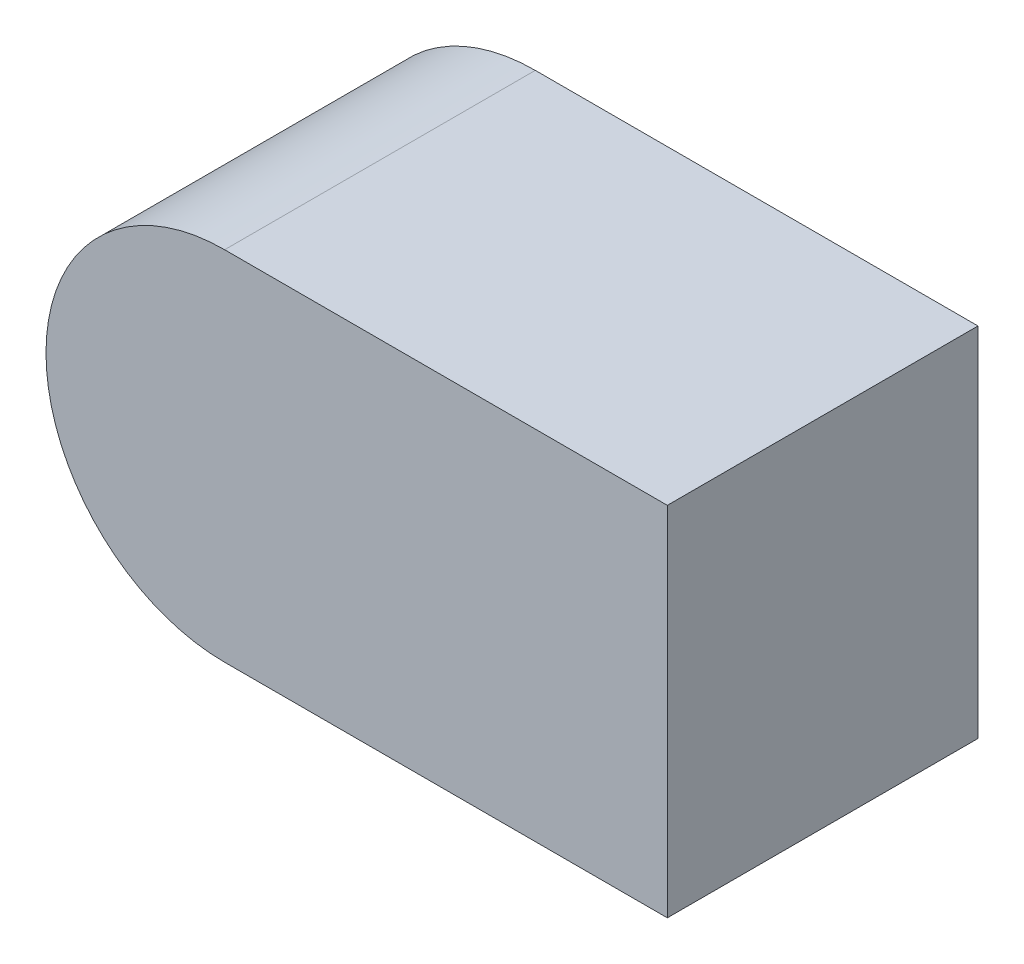
ISO-10303-21;
HEADER;
FILE_DESCRIPTION(('STEP AP214'),'2;1');
FILE_NAME('part.step','',(''),(''),'','','');
FILE_SCHEMA(('AUTOMOTIVE_DESIGN { 1 0 10303 214 1 1 1 1 }'));
ENDSEC;
DATA;
#1=APPLICATION_CONTEXT('core data for automotive mechanical design processes');
#2=APPLICATION_PROTOCOL_DEFINITION('international standard','automotive_design',2000,#1);
#3=PRODUCT_CONTEXT('',#1,'mechanical');
#4=PRODUCT('Part','Part','',(#3));
#5=PRODUCT_RELATED_PRODUCT_CATEGORY('part','',(#4));
#6=PRODUCT_DEFINITION_FORMATION('','',#4);
#7=PRODUCT_DEFINITION_CONTEXT('part definition',#1,'design');
#8=PRODUCT_DEFINITION('design','',#6,#7);
#9=PRODUCT_DEFINITION_SHAPE('','',#8);
#10=(LENGTH_UNIT() NAMED_UNIT(*) SI_UNIT(.MILLI.,.METRE.));
#11=(NAMED_UNIT(*) PLANE_ANGLE_UNIT() SI_UNIT($,.RADIAN.));
#12=(NAMED_UNIT(*) SI_UNIT($,.STERADIAN.) SOLID_ANGLE_UNIT());
#13=UNCERTAINTY_MEASURE_WITH_UNIT(LENGTH_MEASURE(1.E-05),#10,'distance_accuracy_value','');
#14=(GEOMETRIC_REPRESENTATION_CONTEXT(3) GLOBAL_UNCERTAINTY_ASSIGNED_CONTEXT((#13)) GLOBAL_UNIT_ASSIGNED_CONTEXT((#10,
#11,#12)) REPRESENTATION_CONTEXT('',''));
#15=CARTESIAN_POINT('',(0.,0.,0.));
#16=DIRECTION('',(0.,0.,1.));
#17=DIRECTION('',(1.,0.,0.));
#18=AXIS2_PLACEMENT_3D('',#15,#16,#17);
#19=CARTESIAN_POINT('',(2.8335240809167,0.249999999999999,0.2));
#20=DIRECTION('',(0.,0.,1.));
#21=DIRECTION('',(1.,0.,0.));
#22=AXIS2_PLACEMENT_3D('',#19,#20,#21);
#23=PLANE('',#22);
#24=DIRECTION('',(1.,0.,0.));
#25=VECTOR('',#24,1.);
#26=CARTESIAN_POINT('',(2.715,0.135,0.2));
#27=LINE('',#26,#25);
#28=CARTESIAN_POINT('',(2.715,0.135,0.2));
#29=VERTEX_POINT('',#28);
#30=CARTESIAN_POINT('',(3.,0.135,0.2));
#31=VERTEX_POINT('',#30);
#32=EDGE_CURVE('E11',#29,#31,#27,.T.);
#33=ORIENTED_EDGE('',*,*,#32,.T.);
#34=DIRECTION('',(0.,1.,0.));
#35=VECTOR('',#34,1.);
#36=CARTESIAN_POINT('',(3.,-1.375,0.2));
#37=LINE('',#36,#35);
#38=CARTESIAN_POINT('',(3.,0.364999999999999,0.2));
#39=VERTEX_POINT('',#38);
#40=EDGE_CURVE('E24',#31,#39,#37,.T.);
#41=ORIENTED_EDGE('',*,*,#40,.T.);
#42=DIRECTION('',(-1.,0.,0.));
#43=VECTOR('',#42,1.);
#44=CARTESIAN_POINT('',(3.,0.364999999999999,0.2));
#45=LINE('',#44,#43);
#46=CARTESIAN_POINT('',(2.715,0.364999999999999,0.2));
#47=VERTEX_POINT('',#46);
#48=EDGE_CURVE('E88',#39,#47,#45,.T.);
#49=ORIENTED_EDGE('',*,*,#48,.T.);
#50=CARTESIAN_POINT('',(2.715,0.25,0.2));
#51=DIRECTION('',(0.,0.,1.));
#52=DIRECTION('',(0.,1.,0.));
#53=AXIS2_PLACEMENT_3D('',#50,#51,#52);
#54=CIRCLE('',#53,0.115);
#55=EDGE_CURVE('E70',#47,#29,#54,.T.);
#56=ORIENTED_EDGE('',*,*,#55,.T.);
#57=EDGE_LOOP('',(#33,#41,#49,#56));
#58=FACE_BOUND('',#57,.T.);
#59=ADVANCED_FACE('F17',(#58),#23,.T.);
#60=CARTESIAN_POINT('',(3.,-3.,0.));
#61=DIRECTION('',(1.,0.,0.));
#62=DIRECTION('',(0.,1.,0.));
#63=AXIS2_PLACEMENT_3D('',#60,#61,#62);
#64=PLANE('',#63);
#65=DIRECTION('',(0.,0.,-1.));
#66=VECTOR('',#65,1.);
#67=CARTESIAN_POINT('',(3.,0.365,0.));
#68=LINE('',#67,#66);
#69=CARTESIAN_POINT('',(3.,0.364999999999999,0.));
#70=VERTEX_POINT('',#69);
#71=EDGE_CURVE('E76',#39,#70,#68,.T.);
#72=ORIENTED_EDGE('',*,*,#71,.F.);
#73=ORIENTED_EDGE('',*,*,#40,.F.);
#74=DIRECTION('',(0.,0.,1.));
#75=VECTOR('',#74,1.);
#76=CARTESIAN_POINT('',(3.,0.135,0.));
#77=LINE('',#76,#75);
#78=CARTESIAN_POINT('',(3.,0.135,0.));
#79=VERTEX_POINT('',#78);
#80=EDGE_CURVE('E84',#79,#31,#77,.T.);
#81=ORIENTED_EDGE('',*,*,#80,.F.);
#82=DIRECTION('',(0.,1.,0.));
#83=VECTOR('',#82,1.);
#84=CARTESIAN_POINT('',(3.,0.135,0.));
#85=LINE('',#84,#83);
#86=EDGE_CURVE('E82',#79,#70,#85,.T.);
#87=ORIENTED_EDGE('',*,*,#86,.T.);
#88=EDGE_LOOP('',(#72,#73,#81,#87));
#89=FACE_BOUND('',#88,.T.);
#90=ADVANCED_FACE('F90',(#89),#64,.T.);
#91=CARTESIAN_POINT('',(2.715,0.135,0.));
#92=DIRECTION('',(0.,-1.,0.));
#93=DIRECTION('',(1.,0.,0.));
#94=AXIS2_PLACEMENT_3D('',#91,#92,#93);
#95=PLANE('',#94);
#96=DIRECTION('',(1.,0.,0.));
#97=VECTOR('',#96,1.);
#98=CARTESIAN_POINT('',(2.715,0.135,0.));
#99=LINE('',#98,#97);
#100=CARTESIAN_POINT('',(2.715,0.135,0.));
#101=VERTEX_POINT('',#100);
#102=EDGE_CURVE('E61',#101,#79,#99,.T.);
#103=ORIENTED_EDGE('',*,*,#102,.T.);
#104=ORIENTED_EDGE('',*,*,#80,.T.);
#105=ORIENTED_EDGE('',*,*,#32,.F.);
#106=DIRECTION('',(0.,0.,1.));
#107=VECTOR('',#106,1.);
#108=CARTESIAN_POINT('',(2.715,0.135,0.));
#109=LINE('',#108,#107);
#110=EDGE_CURVE('E64',#101,#29,#109,.T.);
#111=ORIENTED_EDGE('',*,*,#110,.F.);
#112=EDGE_LOOP('',(#103,#104,#105,#111));
#113=FACE_BOUND('',#112,.T.);
#114=ADVANCED_FACE('F91',(#113),#95,.T.);
#115=CARTESIAN_POINT('',(2.715,0.25,0.));
#116=DIRECTION('',(0.,0.,1.));
#117=DIRECTION('',(0.,1.,0.));
#118=AXIS2_PLACEMENT_3D('',#115,#116,#117);
#119=CYLINDRICAL_SURFACE('',#118,0.115);
#120=CARTESIAN_POINT('',(2.715,0.25,0.));
#121=DIRECTION('',(0.,0.,1.));
#122=DIRECTION('',(0.,1.,0.));
#123=AXIS2_PLACEMENT_3D('',#120,#121,#122);
#124=CIRCLE('',#123,0.115);
#125=CARTESIAN_POINT('',(2.715,0.364999999999999,0.));
#126=VERTEX_POINT('',#125);
#127=EDGE_CURVE('E54',#126,#101,#124,.T.);
#128=ORIENTED_EDGE('',*,*,#127,.T.);
#129=ORIENTED_EDGE('',*,*,#110,.T.);
#130=ORIENTED_EDGE('',*,*,#55,.F.);
#131=DIRECTION('',(0.,0.,1.));
#132=VECTOR('',#131,1.);
#133=CARTESIAN_POINT('',(2.715,0.364999999999999,0.));
#134=LINE('',#133,#132);
#135=EDGE_CURVE('E65',#126,#47,#134,.T.);
#136=ORIENTED_EDGE('',*,*,#135,.F.);
#137=EDGE_LOOP('',(#128,#129,#130,#136));
#138=FACE_BOUND('',#137,.T.);
#139=ADVANCED_FACE('F69',(#138),#119,.T.);
#140=CARTESIAN_POINT('',(3.,0.364999999999999,0.));
#141=DIRECTION('',(0.,1.,0.));
#142=DIRECTION('',(-1.,0.,0.));
#143=AXIS2_PLACEMENT_3D('',#140,#141,#142);
#144=PLANE('',#143);
#145=DIRECTION('',(-1.,0.,0.));
#146=VECTOR('',#145,1.);
#147=CARTESIAN_POINT('',(3.,0.364999999999999,0.));
#148=LINE('',#147,#146);
#149=EDGE_CURVE('E59',#70,#126,#148,.T.);
#150=ORIENTED_EDGE('',*,*,#149,.T.);
#151=ORIENTED_EDGE('',*,*,#135,.T.);
#152=ORIENTED_EDGE('',*,*,#48,.F.);
#153=ORIENTED_EDGE('',*,*,#71,.T.);
#154=EDGE_LOOP('',(#150,#151,#152,#153));
#155=FACE_BOUND('',#154,.T.);
#156=ADVANCED_FACE('F74',(#155),#144,.T.);
#157=CARTESIAN_POINT('',(2.8335265642716,0.249999999999999,0.));
#158=DIRECTION('',(0.,0.,1.));
#159=DIRECTION('',(-1.,0.,0.));
#160=AXIS2_PLACEMENT_3D('',#157,#158,#159);
#161=PLANE('',#160);
#162=ORIENTED_EDGE('',*,*,#86,.F.);
#163=ORIENTED_EDGE('',*,*,#102,.F.);
#164=ORIENTED_EDGE('',*,*,#127,.F.);
#165=ORIENTED_EDGE('',*,*,#149,.F.);
#166=EDGE_LOOP('',(#162,#163,#164,#165));
#167=FACE_BOUND('',#166,.T.);
#168=ADVANCED_FACE('F57',(#167),#161,.F.);
#169=CLOSED_SHELL('',(#59,#90,#114,#139,#156,#168));
#170=MANIFOLD_SOLID_BREP('B1',#169);
#171=ADVANCED_BREP_SHAPE_REPRESENTATION('',(#18,#170),#14);
#172=SHAPE_DEFINITION_REPRESENTATION(#9,#171);
ENDSEC;
END-ISO-10303-21;
